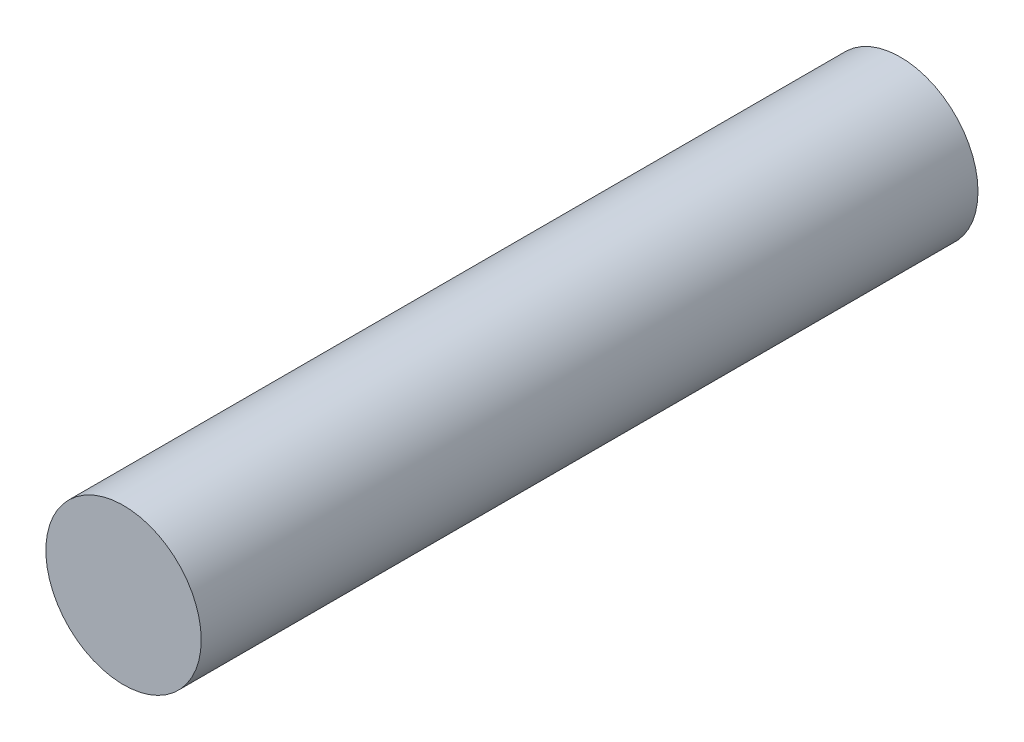
ISO-10303-21;
HEADER;
FILE_DESCRIPTION(('STEP AP214'),'2;1');
FILE_NAME('part.step','',(''),(''),'','','');
FILE_SCHEMA(('AUTOMOTIVE_DESIGN { 1 0 10303 214 1 1 1 1 }'));
ENDSEC;
DATA;
#1=APPLICATION_CONTEXT('core data for automotive mechanical design processes');
#2=APPLICATION_PROTOCOL_DEFINITION('international standard','automotive_design',2000,#1);
#3=PRODUCT_CONTEXT('',#1,'mechanical');
#4=PRODUCT('Part','Part','',(#3));
#5=PRODUCT_RELATED_PRODUCT_CATEGORY('part','',(#4));
#6=PRODUCT_DEFINITION_FORMATION('','',#4);
#7=PRODUCT_DEFINITION_CONTEXT('part definition',#1,'design');
#8=PRODUCT_DEFINITION('design','',#6,#7);
#9=PRODUCT_DEFINITION_SHAPE('','',#8);
#10=(LENGTH_UNIT() NAMED_UNIT(*) SI_UNIT(.MILLI.,.METRE.));
#11=(NAMED_UNIT(*) PLANE_ANGLE_UNIT() SI_UNIT($,.RADIAN.));
#12=(NAMED_UNIT(*) SI_UNIT($,.STERADIAN.) SOLID_ANGLE_UNIT());
#13=UNCERTAINTY_MEASURE_WITH_UNIT(LENGTH_MEASURE(1.E-05),#10,'distance_accuracy_value','');
#14=(GEOMETRIC_REPRESENTATION_CONTEXT(3) GLOBAL_UNCERTAINTY_ASSIGNED_CONTEXT((#13)) GLOBAL_UNIT_ASSIGNED_CONTEXT((#10,
#11,#12)) REPRESENTATION_CONTEXT('',''));
#15=CARTESIAN_POINT('',(0.,0.,0.));
#16=DIRECTION('',(0.,0.,1.));
#17=DIRECTION('',(1.,0.,0.));
#18=AXIS2_PLACEMENT_3D('',#15,#16,#17);
#19=CARTESIAN_POINT('',(0.,0.,15.));
#20=DIRECTION('',(0.,0.,-1.));
#21=DIRECTION('',(-1.,0.,0.));
#22=AXIS2_PLACEMENT_3D('',#19,#20,#21);
#23=CYLINDRICAL_SURFACE('',#22,1.5);
#24=CARTESIAN_POINT('',(0.,0.,15.));
#25=DIRECTION('',(0.,0.,1.));
#26=DIRECTION('',(1.,0.,0.));
#27=AXIS2_PLACEMENT_3D('',#24,#25,#26);
#28=CIRCLE('',#27,1.5);
#29=CARTESIAN_POINT('',(1.5,0.,15.));
#30=VERTEX_POINT('',#29);
#31=EDGE_CURVE('E10',#30,#30,#28,.T.);
#32=ORIENTED_EDGE('',*,*,#31,.F.);
#33=EDGE_LOOP('',(#32));
#34=FACE_BOUND('',#33,.T.);
#35=CARTESIAN_POINT('',(0.,0.,0.));
#36=DIRECTION('',(0.,0.,1.));
#37=DIRECTION('',(1.,0.,0.));
#38=AXIS2_PLACEMENT_3D('',#35,#36,#37);
#39=CIRCLE('',#38,1.5);
#40=CARTESIAN_POINT('',(1.5,0.,0.));
#41=VERTEX_POINT('',#40);
#42=EDGE_CURVE('E34',#41,#41,#39,.T.);
#43=ORIENTED_EDGE('',*,*,#42,.T.);
#44=EDGE_LOOP('',(#43));
#45=FACE_BOUND('',#44,.T.);
#46=ADVANCED_FACE('F31',(#34,#45),#23,.T.);
#47=CARTESIAN_POINT('',(0.,0.,15.));
#48=DIRECTION('',(0.,0.,1.));
#49=DIRECTION('',(1.,0.,0.));
#50=AXIS2_PLACEMENT_3D('',#47,#48,#49);
#51=PLANE('',#50);
#52=ORIENTED_EDGE('',*,*,#31,.T.);
#53=EDGE_LOOP('',(#52));
#54=FACE_BOUND('',#53,.T.);
#55=ADVANCED_FACE('F46',(#54),#51,.T.);
#56=CARTESIAN_POINT('',(0.,0.,0.));
#57=DIRECTION('',(0.,0.,1.));
#58=DIRECTION('',(1.,0.,0.));
#59=AXIS2_PLACEMENT_3D('',#56,#57,#58);
#60=PLANE('',#59);
#61=ORIENTED_EDGE('',*,*,#42,.F.);
#62=EDGE_LOOP('',(#61));
#63=FACE_BOUND('',#62,.T.);
#64=ADVANCED_FACE('F44',(#63),#60,.F.);
#65=CLOSED_SHELL('',(#46,#55,#64));
#66=MANIFOLD_SOLID_BREP('B2',#65);
#67=ADVANCED_BREP_SHAPE_REPRESENTATION('',(#18,#66),#14);
#68=SHAPE_DEFINITION_REPRESENTATION(#9,#67);
ENDSEC;
END-ISO-10303-21;
